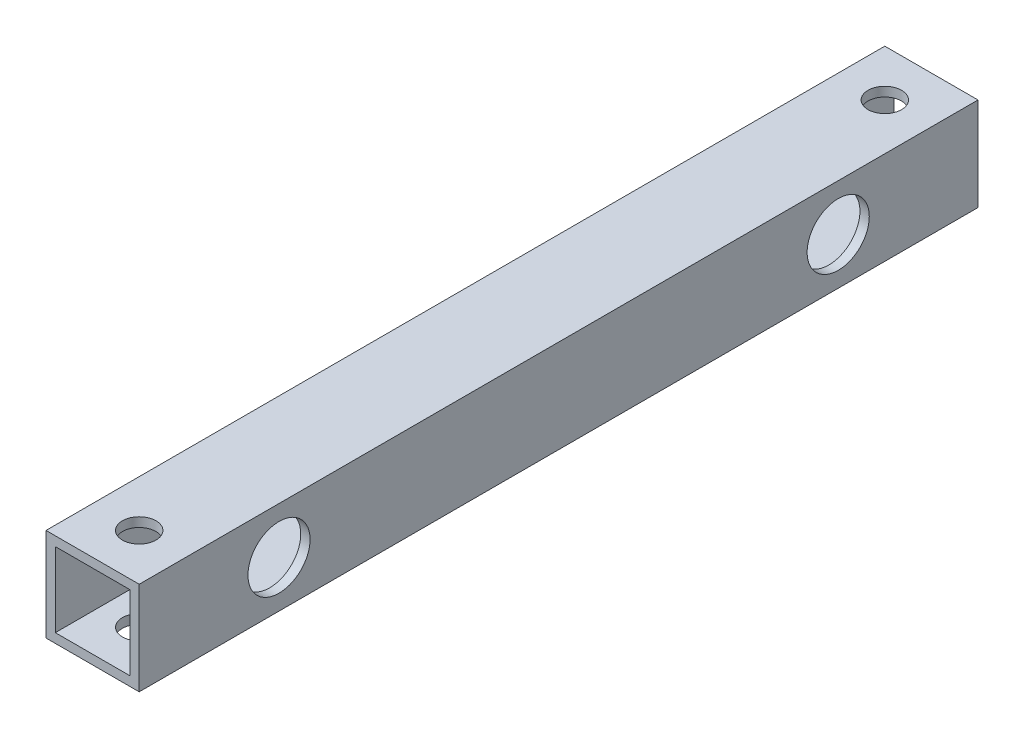
ISO-10303-21;
HEADER;
FILE_DESCRIPTION(('STEP AP214'),'2;1');
FILE_NAME('part.step','',(''),(''),'','','');
FILE_SCHEMA(('AUTOMOTIVE_DESIGN { 1 0 10303 214 1 1 1 1 }'));
ENDSEC;
DATA;
#1=APPLICATION_CONTEXT('core data for automotive mechanical design processes');
#2=APPLICATION_PROTOCOL_DEFINITION('international standard','automotive_design',2000,#1);
#3=PRODUCT_CONTEXT('',#1,'mechanical');
#4=PRODUCT('Part','Part','',(#3));
#5=PRODUCT_RELATED_PRODUCT_CATEGORY('part','',(#4));
#6=PRODUCT_DEFINITION_FORMATION('','',#4);
#7=PRODUCT_DEFINITION_CONTEXT('part definition',#1,'design');
#8=PRODUCT_DEFINITION('design','',#6,#7);
#9=PRODUCT_DEFINITION_SHAPE('','',#8);
#10=(LENGTH_UNIT() NAMED_UNIT(*) SI_UNIT(.MILLI.,.METRE.));
#11=(NAMED_UNIT(*) PLANE_ANGLE_UNIT() SI_UNIT($,.RADIAN.));
#12=(NAMED_UNIT(*) SI_UNIT($,.STERADIAN.) SOLID_ANGLE_UNIT());
#13=UNCERTAINTY_MEASURE_WITH_UNIT(LENGTH_MEASURE(1.E-05),#10,'distance_accuracy_value','');
#14=(GEOMETRIC_REPRESENTATION_CONTEXT(3) GLOBAL_UNCERTAINTY_ASSIGNED_CONTEXT((#13)) GLOBAL_UNIT_ASSIGNED_CONTEXT((#10,
#11,#12)) REPRESENTATION_CONTEXT('',''));
#15=CARTESIAN_POINT('',(0.,0.,0.));
#16=DIRECTION('',(0.,0.,1.));
#17=DIRECTION('',(1.,0.,0.));
#18=AXIS2_PLACEMENT_3D('',#15,#16,#17);
#19=CARTESIAN_POINT('',(0.,0.,135.));
#20=DIRECTION('',(0.,0.,-1.));
#21=DIRECTION('',(-1.,0.,0.));
#22=AXIS2_PLACEMENT_3D('',#19,#20,#21);
#23=PLANE('',#22);
#24=DIRECTION('',(0.,1.,0.));
#25=VECTOR('',#24,1.);
#26=CARTESIAN_POINT('',(7.5,-7.5,135.));
#27=LINE('',#26,#25);
#28=CARTESIAN_POINT('',(7.5,-7.5,135.));
#29=VERTEX_POINT('',#28);
#30=CARTESIAN_POINT('',(7.5,7.5,135.));
#31=VERTEX_POINT('',#30);
#32=EDGE_CURVE('E162',#29,#31,#27,.T.);
#33=ORIENTED_EDGE('',*,*,#32,.T.);
#34=DIRECTION('',(-1.,0.,0.));
#35=VECTOR('',#34,1.);
#36=CARTESIAN_POINT('',(-7.5,7.5,135.));
#37=LINE('',#36,#35);
#38=CARTESIAN_POINT('',(-7.5,7.5,135.));
#39=VERTEX_POINT('',#38);
#40=EDGE_CURVE('E166',#31,#39,#37,.T.);
#41=ORIENTED_EDGE('',*,*,#40,.T.);
#42=DIRECTION('',(0.,-1.,0.));
#43=VECTOR('',#42,1.);
#44=CARTESIAN_POINT('',(-7.5,-7.5,135.));
#45=LINE('',#44,#43);
#46=CARTESIAN_POINT('',(-7.5,-7.5,135.));
#47=VERTEX_POINT('',#46);
#48=EDGE_CURVE('E170',#39,#47,#45,.T.);
#49=ORIENTED_EDGE('',*,*,#48,.T.);
#50=DIRECTION('',(1.,0.,0.));
#51=VECTOR('',#50,1.);
#52=CARTESIAN_POINT('',(-7.5,-7.5,135.));
#53=LINE('',#52,#51);
#54=EDGE_CURVE('E173',#47,#29,#53,.T.);
#55=ORIENTED_EDGE('',*,*,#54,.T.);
#56=EDGE_LOOP('',(#33,#41,#49,#55));
#57=FACE_BOUND('',#56,.T.);
#58=DIRECTION('',(0.,1.,0.));
#59=VECTOR('',#58,1.);
#60=CARTESIAN_POINT('',(6.,-6.,135.));
#61=LINE('',#60,#59);
#62=CARTESIAN_POINT('',(6.,-6.,135.));
#63=VERTEX_POINT('',#62);
#64=CARTESIAN_POINT('',(6.,6.,135.));
#65=VERTEX_POINT('',#64);
#66=EDGE_CURVE('E111',#63,#65,#61,.T.);
#67=ORIENTED_EDGE('',*,*,#66,.F.);
#68=DIRECTION('',(1.,0.,0.));
#69=VECTOR('',#68,1.);
#70=CARTESIAN_POINT('',(-6.,-6.,135.));
#71=LINE('',#70,#69);
#72=CARTESIAN_POINT('',(-6.,-6.,135.));
#73=VERTEX_POINT('',#72);
#74=EDGE_CURVE('E138',#73,#63,#71,.T.);
#75=ORIENTED_EDGE('',*,*,#74,.F.);
#76=DIRECTION('',(0.,-1.,0.));
#77=VECTOR('',#76,1.);
#78=CARTESIAN_POINT('',(-6.,-6.,135.));
#79=LINE('',#78,#77);
#80=CARTESIAN_POINT('',(-6.,6.,135.));
#81=VERTEX_POINT('',#80);
#82=EDGE_CURVE('E133',#81,#73,#79,.T.);
#83=ORIENTED_EDGE('',*,*,#82,.F.);
#84=DIRECTION('',(-1.,0.,0.));
#85=VECTOR('',#84,1.);
#86=CARTESIAN_POINT('',(-6.,6.,135.));
#87=LINE('',#86,#85);
#88=EDGE_CURVE('E120',#65,#81,#87,.T.);
#89=ORIENTED_EDGE('',*,*,#88,.F.);
#90=EDGE_LOOP('',(#67,#75,#83,#89));
#91=FACE_BOUND('',#90,.T.);
#92=ADVANCED_FACE('F43',(#57,#91),#23,.F.);
#93=CARTESIAN_POINT('',(0.,0.,0.));
#94=DIRECTION('',(0.,0.,-1.));
#95=DIRECTION('',(-1.,0.,0.));
#96=AXIS2_PLACEMENT_3D('',#93,#94,#95);
#97=PLANE('',#96);
#98=DIRECTION('',(0.,1.,0.));
#99=VECTOR('',#98,1.);
#100=CARTESIAN_POINT('',(7.5,-7.5,0.));
#101=LINE('',#100,#99);
#102=CARTESIAN_POINT('',(7.5,-7.5,0.));
#103=VERTEX_POINT('',#102);
#104=CARTESIAN_POINT('',(7.5,7.5,0.));
#105=VERTEX_POINT('',#104);
#106=EDGE_CURVE('E129',#103,#105,#101,.T.);
#107=ORIENTED_EDGE('',*,*,#106,.F.);
#108=DIRECTION('',(1.,0.,0.));
#109=VECTOR('',#108,1.);
#110=CARTESIAN_POINT('',(-7.5,-7.5,0.));
#111=LINE('',#110,#109);
#112=CARTESIAN_POINT('',(-7.5,-7.5,0.));
#113=VERTEX_POINT('',#112);
#114=EDGE_CURVE('E167',#113,#103,#111,.T.);
#115=ORIENTED_EDGE('',*,*,#114,.F.);
#116=DIRECTION('',(0.,-1.,0.));
#117=VECTOR('',#116,1.);
#118=CARTESIAN_POINT('',(-7.5,-7.5,0.));
#119=LINE('',#118,#117);
#120=CARTESIAN_POINT('',(-7.5,7.5,0.));
#121=VERTEX_POINT('',#120);
#122=EDGE_CURVE('E183',#121,#113,#119,.T.);
#123=ORIENTED_EDGE('',*,*,#122,.F.);
#124=DIRECTION('',(-1.,0.,0.));
#125=VECTOR('',#124,1.);
#126=CARTESIAN_POINT('',(-7.5,7.5,0.));
#127=LINE('',#126,#125);
#128=EDGE_CURVE('E180',#105,#121,#127,.T.);
#129=ORIENTED_EDGE('',*,*,#128,.F.);
#130=EDGE_LOOP('',(#107,#115,#123,#129));
#131=FACE_BOUND('',#130,.T.);
#132=DIRECTION('',(1.,0.,0.));
#133=VECTOR('',#132,1.);
#134=CARTESIAN_POINT('',(-6.,-6.,0.));
#135=LINE('',#134,#133);
#136=CARTESIAN_POINT('',(-6.,-6.,0.));
#137=VERTEX_POINT('',#136);
#138=CARTESIAN_POINT('',(6.,-6.,0.));
#139=VERTEX_POINT('',#138);
#140=EDGE_CURVE('E121',#137,#139,#135,.T.);
#141=ORIENTED_EDGE('',*,*,#140,.T.);
#142=DIRECTION('',(0.,1.,0.));
#143=VECTOR('',#142,1.);
#144=CARTESIAN_POINT('',(6.,-6.,0.));
#145=LINE('',#144,#143);
#146=CARTESIAN_POINT('',(6.,6.,0.));
#147=VERTEX_POINT('',#146);
#148=EDGE_CURVE('E69',#139,#147,#145,.T.);
#149=ORIENTED_EDGE('',*,*,#148,.T.);
#150=DIRECTION('',(-1.,0.,0.));
#151=VECTOR('',#150,1.);
#152=CARTESIAN_POINT('',(-6.,6.,0.));
#153=LINE('',#152,#151);
#154=CARTESIAN_POINT('',(-6.,6.,0.));
#155=VERTEX_POINT('',#154);
#156=EDGE_CURVE('E127',#147,#155,#153,.T.);
#157=ORIENTED_EDGE('',*,*,#156,.T.);
#158=DIRECTION('',(0.,-1.,0.));
#159=VECTOR('',#158,1.);
#160=CARTESIAN_POINT('',(-6.,-6.,0.));
#161=LINE('',#160,#159);
#162=EDGE_CURVE('E149',#155,#137,#161,.T.);
#163=ORIENTED_EDGE('',*,*,#162,.T.);
#164=EDGE_LOOP('',(#141,#149,#157,#163));
#165=FACE_BOUND('',#164,.T.);
#166=ADVANCED_FACE('F287',(#131,#165),#97,.T.);
#167=CARTESIAN_POINT('',(7.5,-7.5,135.));
#168=DIRECTION('',(-1.,0.,0.));
#169=DIRECTION('',(0.,0.,1.));
#170=AXIS2_PLACEMENT_3D('',#167,#168,#169);
#171=PLANE('',#170);
#172=CARTESIAN_POINT('',(7.5,0.,22.5));
#173=DIRECTION('',(1.,0.,0.));
#174=DIRECTION('',(0.,0.,-1.));
#175=AXIS2_PLACEMENT_3D('',#172,#173,#174);
#176=CIRCLE('',#175,5.);
#177=CARTESIAN_POINT('',(7.5,0.,17.5));
#178=VERTEX_POINT('',#177);
#179=EDGE_CURVE('E222',#178,#178,#176,.T.);
#180=ORIENTED_EDGE('',*,*,#179,.F.);
#181=EDGE_LOOP('',(#180));
#182=FACE_BOUND('',#181,.T.);
#183=CARTESIAN_POINT('',(7.5,0.,112.5));
#184=DIRECTION('',(1.,0.,0.));
#185=DIRECTION('',(0.,0.,-1.));
#186=AXIS2_PLACEMENT_3D('',#183,#184,#185);
#187=CIRCLE('',#186,5.);
#188=CARTESIAN_POINT('',(7.5,0.,107.5));
#189=VERTEX_POINT('',#188);
#190=EDGE_CURVE('E231',#189,#189,#187,.T.);
#191=ORIENTED_EDGE('',*,*,#190,.F.);
#192=EDGE_LOOP('',(#191));
#193=FACE_BOUND('',#192,.T.);
#194=ORIENTED_EDGE('',*,*,#106,.T.);
#195=DIRECTION('',(0.,0.,-1.));
#196=VECTOR('',#195,1.);
#197=CARTESIAN_POINT('',(7.5,7.5,135.));
#198=LINE('',#197,#196);
#199=EDGE_CURVE('E11',#31,#105,#198,.T.);
#200=ORIENTED_EDGE('',*,*,#199,.F.);
#201=ORIENTED_EDGE('',*,*,#32,.F.);
#202=DIRECTION('',(0.,0.,-1.));
#203=VECTOR('',#202,1.);
#204=CARTESIAN_POINT('',(7.5,-7.5,135.));
#205=LINE('',#204,#203);
#206=EDGE_CURVE('E176',#29,#103,#205,.T.);
#207=ORIENTED_EDGE('',*,*,#206,.T.);
#208=EDGE_LOOP('',(#194,#200,#201,#207));
#209=FACE_BOUND('',#208,.T.);
#210=ADVANCED_FACE('F45',(#182,#193,#209),#171,.F.);
#211=CARTESIAN_POINT('',(-7.5,7.5,135.));
#212=DIRECTION('',(0.,-1.,0.));
#213=DIRECTION('',(0.,0.,-1.));
#214=AXIS2_PLACEMENT_3D('',#211,#212,#213);
#215=PLANE('',#214);
#216=CARTESIAN_POINT('',(0.,7.5,7.50000000000001));
#217=DIRECTION('',(0.,1.,0.));
#218=DIRECTION('',(0.,0.,1.));
#219=AXIS2_PLACEMENT_3D('',#216,#217,#218);
#220=CIRCLE('',#219,2.7);
#221=CARTESIAN_POINT('',(0.,7.5,10.2));
#222=VERTEX_POINT('',#221);
#223=EDGE_CURVE('E213',#222,#222,#220,.T.);
#224=ORIENTED_EDGE('',*,*,#223,.F.);
#225=EDGE_LOOP('',(#224));
#226=FACE_BOUND('',#225,.T.);
#227=CARTESIAN_POINT('',(0.,7.5,127.5));
#228=DIRECTION('',(0.,1.,0.));
#229=DIRECTION('',(0.,0.,1.));
#230=AXIS2_PLACEMENT_3D('',#227,#228,#229);
#231=CIRCLE('',#230,2.7);
#232=CARTESIAN_POINT('',(0.,7.5,130.2));
#233=VERTEX_POINT('',#232);
#234=EDGE_CURVE('E229',#233,#233,#231,.T.);
#235=ORIENTED_EDGE('',*,*,#234,.F.);
#236=EDGE_LOOP('',(#235));
#237=FACE_BOUND('',#236,.T.);
#238=ORIENTED_EDGE('',*,*,#128,.T.);
#239=DIRECTION('',(0.,0.,-1.));
#240=VECTOR('',#239,1.);
#241=CARTESIAN_POINT('',(-7.5,7.5,135.));
#242=LINE('',#241,#240);
#243=EDGE_CURVE('E53',#39,#121,#242,.T.);
#244=ORIENTED_EDGE('',*,*,#243,.F.);
#245=ORIENTED_EDGE('',*,*,#40,.F.);
#246=ORIENTED_EDGE('',*,*,#199,.T.);
#247=EDGE_LOOP('',(#238,#244,#245,#246));
#248=FACE_BOUND('',#247,.T.);
#249=ADVANCED_FACE('F303',(#226,#237,#248),#215,.F.);
#250=CARTESIAN_POINT('',(-7.5,-7.5,135.));
#251=DIRECTION('',(1.,0.,0.));
#252=DIRECTION('',(0.,0.,-1.));
#253=AXIS2_PLACEMENT_3D('',#250,#251,#252);
#254=PLANE('',#253);
#255=CARTESIAN_POINT('',(-7.5,0.,112.5));
#256=DIRECTION('',(1.,0.,0.));
#257=DIRECTION('',(0.,0.,-1.));
#258=AXIS2_PLACEMENT_3D('',#255,#256,#257);
#259=CIRCLE('',#258,2.7);
#260=CARTESIAN_POINT('',(-7.5,0.,109.8));
#261=VERTEX_POINT('',#260);
#262=EDGE_CURVE('E146',#261,#261,#259,.T.);
#263=ORIENTED_EDGE('',*,*,#262,.T.);
#264=EDGE_LOOP('',(#263));
#265=FACE_BOUND('',#264,.T.);
#266=CARTESIAN_POINT('',(-7.5,0.,22.5));
#267=DIRECTION('',(1.,0.,0.));
#268=DIRECTION('',(0.,0.,-1.));
#269=AXIS2_PLACEMENT_3D('',#266,#267,#268);
#270=CIRCLE('',#269,2.7);
#271=CARTESIAN_POINT('',(-7.5,0.,19.8));
#272=VERTEX_POINT('',#271);
#273=EDGE_CURVE('E202',#272,#272,#270,.T.);
#274=ORIENTED_EDGE('',*,*,#273,.T.);
#275=EDGE_LOOP('',(#274));
#276=FACE_BOUND('',#275,.T.);
#277=ORIENTED_EDGE('',*,*,#122,.T.);
#278=DIRECTION('',(0.,0.,-1.));
#279=VECTOR('',#278,1.);
#280=CARTESIAN_POINT('',(-7.5,-7.5,135.));
#281=LINE('',#280,#279);
#282=EDGE_CURVE('E191',#47,#113,#281,.T.);
#283=ORIENTED_EDGE('',*,*,#282,.F.);
#284=ORIENTED_EDGE('',*,*,#48,.F.);
#285=ORIENTED_EDGE('',*,*,#243,.T.);
#286=EDGE_LOOP('',(#277,#283,#284,#285));
#287=FACE_BOUND('',#286,.T.);
#288=ADVANCED_FACE('F265',(#265,#276,#287),#254,.F.);
#289=CARTESIAN_POINT('',(-7.5,-7.5,135.));
#290=DIRECTION('',(0.,1.,0.));
#291=DIRECTION('',(0.,0.,1.));
#292=AXIS2_PLACEMENT_3D('',#289,#290,#291);
#293=PLANE('',#292);
#294=CARTESIAN_POINT('',(0.,-7.5,7.50000000000001));
#295=DIRECTION('',(0.,1.,0.));
#296=DIRECTION('',(0.,0.,1.));
#297=AXIS2_PLACEMENT_3D('',#294,#295,#296);
#298=CIRCLE('',#297,2.7);
#299=CARTESIAN_POINT('',(0.,-7.5,10.2));
#300=VERTEX_POINT('',#299);
#301=EDGE_CURVE('E203',#300,#300,#298,.T.);
#302=ORIENTED_EDGE('',*,*,#301,.T.);
#303=EDGE_LOOP('',(#302));
#304=FACE_BOUND('',#303,.T.);
#305=CARTESIAN_POINT('',(0.,-7.5,127.5));
#306=DIRECTION('',(0.,1.,0.));
#307=DIRECTION('',(0.,0.,1.));
#308=AXIS2_PLACEMENT_3D('',#305,#306,#307);
#309=CIRCLE('',#308,2.7);
#310=CARTESIAN_POINT('',(0.,-7.5,130.2));
#311=VERTEX_POINT('',#310);
#312=EDGE_CURVE('E218',#311,#311,#309,.T.);
#313=ORIENTED_EDGE('',*,*,#312,.T.);
#314=EDGE_LOOP('',(#313));
#315=FACE_BOUND('',#314,.T.);
#316=ORIENTED_EDGE('',*,*,#114,.T.);
#317=ORIENTED_EDGE('',*,*,#206,.F.);
#318=ORIENTED_EDGE('',*,*,#54,.F.);
#319=ORIENTED_EDGE('',*,*,#282,.T.);
#320=EDGE_LOOP('',(#316,#317,#318,#319));
#321=FACE_BOUND('',#320,.T.);
#322=ADVANCED_FACE('F298',(#304,#315,#321),#293,.F.);
#323=CARTESIAN_POINT('',(6.,-6.,135.));
#324=DIRECTION('',(-1.,0.,0.));
#325=DIRECTION('',(0.,0.,1.));
#326=AXIS2_PLACEMENT_3D('',#323,#324,#325);
#327=PLANE('',#326);
#328=CARTESIAN_POINT('',(6.,0.,22.5));
#329=DIRECTION('',(-1.,0.,0.));
#330=DIRECTION('',(0.,0.,1.));
#331=AXIS2_PLACEMENT_3D('',#328,#329,#330);
#332=CIRCLE('',#331,5.);
#333=CARTESIAN_POINT('',(6.,0.,27.5));
#334=VERTEX_POINT('',#333);
#335=EDGE_CURVE('E47',#334,#334,#332,.T.);
#336=ORIENTED_EDGE('',*,*,#335,.F.);
#337=EDGE_LOOP('',(#336));
#338=FACE_BOUND('',#337,.T.);
#339=CARTESIAN_POINT('',(6.,0.,112.5));
#340=DIRECTION('',(-1.,0.,0.));
#341=DIRECTION('',(0.,0.,1.));
#342=AXIS2_PLACEMENT_3D('',#339,#340,#341);
#343=CIRCLE('',#342,5.);
#344=CARTESIAN_POINT('',(6.,0.,117.5));
#345=VERTEX_POINT('',#344);
#346=EDGE_CURVE('E219',#345,#345,#343,.T.);
#347=ORIENTED_EDGE('',*,*,#346,.F.);
#348=EDGE_LOOP('',(#347));
#349=FACE_BOUND('',#348,.T.);
#350=ORIENTED_EDGE('',*,*,#148,.F.);
#351=DIRECTION('',(0.,0.,-1.));
#352=VECTOR('',#351,1.);
#353=CARTESIAN_POINT('',(6.,-6.,135.));
#354=LINE('',#353,#352);
#355=EDGE_CURVE('E115',#63,#139,#354,.T.);
#356=ORIENTED_EDGE('',*,*,#355,.F.);
#357=ORIENTED_EDGE('',*,*,#66,.T.);
#358=DIRECTION('',(0.,0.,-1.));
#359=VECTOR('',#358,1.);
#360=CARTESIAN_POINT('',(6.,6.,135.));
#361=LINE('',#360,#359);
#362=EDGE_CURVE('E114',#65,#147,#361,.T.);
#363=ORIENTED_EDGE('',*,*,#362,.T.);
#364=EDGE_LOOP('',(#350,#356,#357,#363));
#365=FACE_BOUND('',#364,.T.);
#366=ADVANCED_FACE('F113',(#338,#349,#365),#327,.T.);
#367=CARTESIAN_POINT('',(-6.,6.,135.));
#368=DIRECTION('',(0.,-1.,0.));
#369=DIRECTION('',(0.,0.,-1.));
#370=AXIS2_PLACEMENT_3D('',#367,#368,#369);
#371=PLANE('',#370);
#372=CARTESIAN_POINT('',(0.,6.,7.50000000000001));
#373=DIRECTION('',(0.,-1.,0.));
#374=DIRECTION('',(0.,0.,-1.));
#375=AXIS2_PLACEMENT_3D('',#372,#373,#374);
#376=CIRCLE('',#375,2.7);
#377=CARTESIAN_POINT('',(0.,6.,4.80000000000001));
#378=VERTEX_POINT('',#377);
#379=EDGE_CURVE('E217',#378,#378,#376,.T.);
#380=ORIENTED_EDGE('',*,*,#379,.F.);
#381=EDGE_LOOP('',(#380));
#382=FACE_BOUND('',#381,.T.);
#383=CARTESIAN_POINT('',(0.,6.,127.5));
#384=DIRECTION('',(0.,-1.,0.));
#385=DIRECTION('',(0.,0.,-1.));
#386=AXIS2_PLACEMENT_3D('',#383,#384,#385);
#387=CIRCLE('',#386,2.7);
#388=CARTESIAN_POINT('',(0.,6.,124.8));
#389=VERTEX_POINT('',#388);
#390=EDGE_CURVE('E212',#389,#389,#387,.T.);
#391=ORIENTED_EDGE('',*,*,#390,.F.);
#392=EDGE_LOOP('',(#391));
#393=FACE_BOUND('',#392,.T.);
#394=ORIENTED_EDGE('',*,*,#156,.F.);
#395=ORIENTED_EDGE('',*,*,#362,.F.);
#396=ORIENTED_EDGE('',*,*,#88,.T.);
#397=DIRECTION('',(0.,0.,-1.));
#398=VECTOR('',#397,1.);
#399=CARTESIAN_POINT('',(-6.,6.,135.));
#400=LINE('',#399,#398);
#401=EDGE_CURVE('E130',#81,#155,#400,.T.);
#402=ORIENTED_EDGE('',*,*,#401,.T.);
#403=EDGE_LOOP('',(#394,#395,#396,#402));
#404=FACE_BOUND('',#403,.T.);
#405=ADVANCED_FACE('F124',(#382,#393,#404),#371,.T.);
#406=CARTESIAN_POINT('',(-6.,-6.,135.));
#407=DIRECTION('',(1.,0.,0.));
#408=DIRECTION('',(0.,0.,-1.));
#409=AXIS2_PLACEMENT_3D('',#406,#407,#408);
#410=PLANE('',#409);
#411=CARTESIAN_POINT('',(-6.,0.,112.5));
#412=DIRECTION('',(1.,0.,0.));
#413=DIRECTION('',(0.,0.,-1.));
#414=AXIS2_PLACEMENT_3D('',#411,#412,#413);
#415=CIRCLE('',#414,2.7);
#416=CARTESIAN_POINT('',(-6.,0.,109.8));
#417=VERTEX_POINT('',#416);
#418=EDGE_CURVE('E204',#417,#417,#415,.T.);
#419=ORIENTED_EDGE('',*,*,#418,.F.);
#420=EDGE_LOOP('',(#419));
#421=FACE_BOUND('',#420,.T.);
#422=CARTESIAN_POINT('',(-6.,0.,22.5));
#423=DIRECTION('',(1.,0.,0.));
#424=DIRECTION('',(0.,0.,-1.));
#425=AXIS2_PLACEMENT_3D('',#422,#423,#424);
#426=CIRCLE('',#425,2.7);
#427=CARTESIAN_POINT('',(-6.,0.,19.8));
#428=VERTEX_POINT('',#427);
#429=EDGE_CURVE('E198',#428,#428,#426,.T.);
#430=ORIENTED_EDGE('',*,*,#429,.F.);
#431=EDGE_LOOP('',(#430));
#432=FACE_BOUND('',#431,.T.);
#433=ORIENTED_EDGE('',*,*,#162,.F.);
#434=ORIENTED_EDGE('',*,*,#401,.F.);
#435=ORIENTED_EDGE('',*,*,#82,.T.);
#436=DIRECTION('',(0.,0.,-1.));
#437=VECTOR('',#436,1.);
#438=CARTESIAN_POINT('',(-6.,-6.,135.));
#439=LINE('',#438,#437);
#440=EDGE_CURVE('E61',#73,#137,#439,.T.);
#441=ORIENTED_EDGE('',*,*,#440,.T.);
#442=EDGE_LOOP('',(#433,#434,#435,#441));
#443=FACE_BOUND('',#442,.T.);
#444=ADVANCED_FACE('F329',(#421,#432,#443),#410,.T.);
#445=CARTESIAN_POINT('',(-6.,-6.,135.));
#446=DIRECTION('',(0.,1.,0.));
#447=DIRECTION('',(0.,0.,1.));
#448=AXIS2_PLACEMENT_3D('',#445,#446,#447);
#449=PLANE('',#448);
#450=CARTESIAN_POINT('',(0.,-6.,7.50000000000001));
#451=DIRECTION('',(0.,1.,0.));
#452=DIRECTION('',(0.,0.,1.));
#453=AXIS2_PLACEMENT_3D('',#450,#451,#452);
#454=CIRCLE('',#453,2.7);
#455=CARTESIAN_POINT('',(0.,-6.,10.2));
#456=VERTEX_POINT('',#455);
#457=EDGE_CURVE('E214',#456,#456,#454,.T.);
#458=ORIENTED_EDGE('',*,*,#457,.F.);
#459=EDGE_LOOP('',(#458));
#460=FACE_BOUND('',#459,.T.);
#461=CARTESIAN_POINT('',(0.,-6.,127.5));
#462=DIRECTION('',(0.,1.,0.));
#463=DIRECTION('',(0.,0.,1.));
#464=AXIS2_PLACEMENT_3D('',#461,#462,#463);
#465=CIRCLE('',#464,2.7);
#466=CARTESIAN_POINT('',(0.,-6.,130.2));
#467=VERTEX_POINT('',#466);
#468=EDGE_CURVE('E208',#467,#467,#465,.T.);
#469=ORIENTED_EDGE('',*,*,#468,.F.);
#470=EDGE_LOOP('',(#469));
#471=FACE_BOUND('',#470,.T.);
#472=ORIENTED_EDGE('',*,*,#140,.F.);
#473=ORIENTED_EDGE('',*,*,#440,.F.);
#474=ORIENTED_EDGE('',*,*,#74,.T.);
#475=ORIENTED_EDGE('',*,*,#355,.T.);
#476=EDGE_LOOP('',(#472,#473,#474,#475));
#477=FACE_BOUND('',#476,.T.);
#478=ADVANCED_FACE('F283',(#460,#471,#477),#449,.T.);
#479=CARTESIAN_POINT('',(-17.5,0.,22.5));
#480=DIRECTION('',(1.,0.,0.));
#481=DIRECTION('',(0.,0.,-1.));
#482=AXIS2_PLACEMENT_3D('',#479,#480,#481);
#483=CYLINDRICAL_SURFACE('',#482,2.7);
#484=ORIENTED_EDGE('',*,*,#429,.T.);
#485=EDGE_LOOP('',(#484));
#486=FACE_BOUND('',#485,.T.);
#487=ORIENTED_EDGE('',*,*,#273,.F.);
#488=EDGE_LOOP('',(#487));
#489=FACE_BOUND('',#488,.T.);
#490=ADVANCED_FACE('F271',(#486,#489),#483,.F.);
#491=CARTESIAN_POINT('',(-17.5,0.,112.5));
#492=DIRECTION('',(1.,0.,0.));
#493=DIRECTION('',(0.,0.,-1.));
#494=AXIS2_PLACEMENT_3D('',#491,#492,#493);
#495=CYLINDRICAL_SURFACE('',#494,2.7);
#496=ORIENTED_EDGE('',*,*,#418,.T.);
#497=EDGE_LOOP('',(#496));
#498=FACE_BOUND('',#497,.T.);
#499=ORIENTED_EDGE('',*,*,#262,.F.);
#500=EDGE_LOOP('',(#499));
#501=FACE_BOUND('',#500,.T.);
#502=ADVANCED_FACE('F268',(#498,#501),#495,.F.);
#503=CARTESIAN_POINT('',(0.,-17.5,127.5));
#504=DIRECTION('',(0.,1.,0.));
#505=DIRECTION('',(0.,0.,1.));
#506=AXIS2_PLACEMENT_3D('',#503,#504,#505);
#507=CYLINDRICAL_SURFACE('',#506,2.7);
#508=ORIENTED_EDGE('',*,*,#468,.T.);
#509=EDGE_LOOP('',(#508));
#510=FACE_BOUND('',#509,.T.);
#511=ORIENTED_EDGE('',*,*,#312,.F.);
#512=EDGE_LOOP('',(#511));
#513=FACE_BOUND('',#512,.T.);
#514=ADVANCED_FACE('F270',(#510,#513),#507,.F.);
#515=CARTESIAN_POINT('',(0.,-17.5,7.50000000000001));
#516=DIRECTION('',(0.,1.,0.));
#517=DIRECTION('',(0.,0.,1.));
#518=AXIS2_PLACEMENT_3D('',#515,#516,#517);
#519=CYLINDRICAL_SURFACE('',#518,2.7);
#520=ORIENTED_EDGE('',*,*,#457,.T.);
#521=EDGE_LOOP('',(#520));
#522=FACE_BOUND('',#521,.T.);
#523=ORIENTED_EDGE('',*,*,#301,.F.);
#524=EDGE_LOOP('',(#523));
#525=FACE_BOUND('',#524,.T.);
#526=ADVANCED_FACE('F279',(#522,#525),#519,.F.);
#527=ORIENTED_EDGE('',*,*,#390,.T.);
#528=EDGE_LOOP('',(#527));
#529=FACE_BOUND('',#528,.T.);
#530=ORIENTED_EDGE('',*,*,#234,.T.);
#531=EDGE_LOOP('',(#530));
#532=FACE_BOUND('',#531,.T.);
#533=ADVANCED_FACE('F282',(#529,#532),#507,.F.);
#534=ORIENTED_EDGE('',*,*,#379,.T.);
#535=EDGE_LOOP('',(#534));
#536=FACE_BOUND('',#535,.T.);
#537=ORIENTED_EDGE('',*,*,#223,.T.);
#538=EDGE_LOOP('',(#537));
#539=FACE_BOUND('',#538,.T.);
#540=ADVANCED_FACE('F351',(#536,#539),#519,.F.);
#541=CARTESIAN_POINT('',(-2.5,0.,112.5));
#542=DIRECTION('',(1.,0.,0.));
#543=DIRECTION('',(0.,0.,-1.));
#544=AXIS2_PLACEMENT_3D('',#541,#542,#543);
#545=CYLINDRICAL_SURFACE('',#544,5.);
#546=ORIENTED_EDGE('',*,*,#346,.T.);
#547=EDGE_LOOP('',(#546));
#548=FACE_BOUND('',#547,.T.);
#549=ORIENTED_EDGE('',*,*,#190,.T.);
#550=EDGE_LOOP('',(#549));
#551=FACE_BOUND('',#550,.T.);
#552=ADVANCED_FACE('F356',(#548,#551),#545,.F.);
#553=CARTESIAN_POINT('',(-2.5,0.,22.5));
#554=DIRECTION('',(1.,0.,0.));
#555=DIRECTION('',(0.,0.,-1.));
#556=AXIS2_PLACEMENT_3D('',#553,#554,#555);
#557=CYLINDRICAL_SURFACE('',#556,5.);
#558=ORIENTED_EDGE('',*,*,#335,.T.);
#559=EDGE_LOOP('',(#558));
#560=FACE_BOUND('',#559,.T.);
#561=ORIENTED_EDGE('',*,*,#179,.T.);
#562=EDGE_LOOP('',(#561));
#563=FACE_BOUND('',#562,.T.);
#564=ADVANCED_FACE('F363',(#560,#563),#557,.F.);
#565=CLOSED_SHELL('',(#92,#166,#210,#249,#288,#322,#366,#405,#444,#478,#490,#502,#514,#526,#533,
#540,#552,#564));
#566=MANIFOLD_SOLID_BREP('B2',#565);
#567=ADVANCED_BREP_SHAPE_REPRESENTATION('',(#18,#566),#14);
#568=SHAPE_DEFINITION_REPRESENTATION(#9,#567);
ENDSEC;
END-ISO-10303-21;
